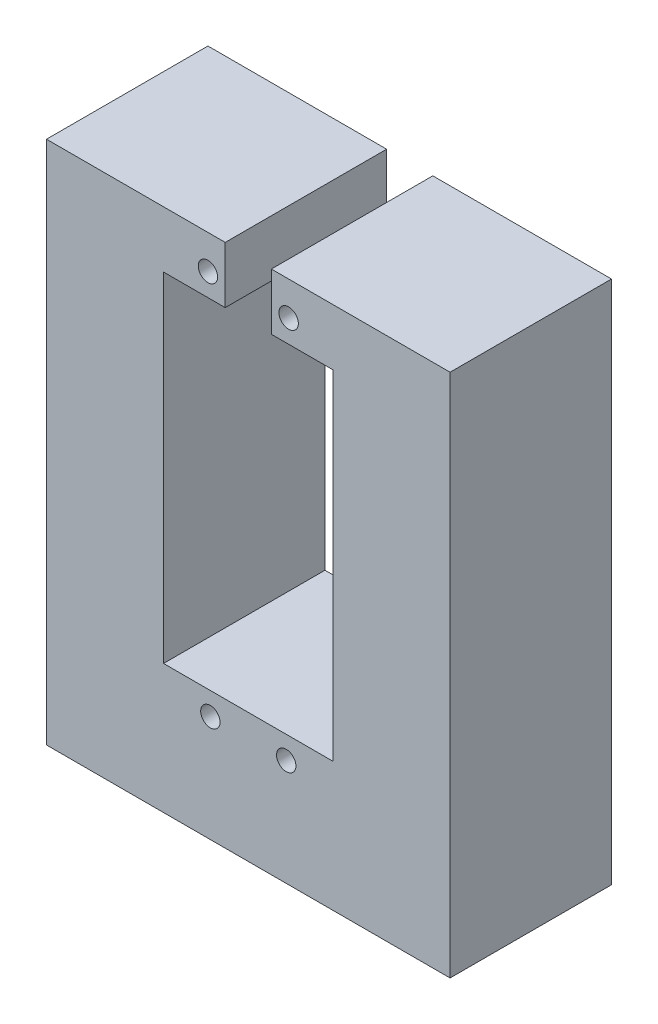
ISO-10303-21;
HEADER;
FILE_DESCRIPTION(('STEP AP214'),'2;1');
FILE_NAME('part.step','',(''),(''),'','','');
FILE_SCHEMA(('AUTOMOTIVE_DESIGN { 1 0 10303 214 1 1 1 1 }'));
ENDSEC;
DATA;
#1=APPLICATION_CONTEXT('core data for automotive mechanical design processes');
#2=APPLICATION_PROTOCOL_DEFINITION('international standard','automotive_design',2000,#1);
#3=PRODUCT_CONTEXT('',#1,'mechanical');
#4=PRODUCT('Part','Part','',(#3));
#5=PRODUCT_RELATED_PRODUCT_CATEGORY('part','',(#4));
#6=PRODUCT_DEFINITION_FORMATION('','',#4);
#7=PRODUCT_DEFINITION_CONTEXT('part definition',#1,'design');
#8=PRODUCT_DEFINITION('design','',#6,#7);
#9=PRODUCT_DEFINITION_SHAPE('','',#8);
#10=(LENGTH_UNIT() NAMED_UNIT(*) SI_UNIT(.MILLI.,.METRE.));
#11=(NAMED_UNIT(*) PLANE_ANGLE_UNIT() SI_UNIT($,.RADIAN.));
#12=(NAMED_UNIT(*) SI_UNIT($,.STERADIAN.) SOLID_ANGLE_UNIT());
#13=UNCERTAINTY_MEASURE_WITH_UNIT(LENGTH_MEASURE(1.E-05),#10,'distance_accuracy_value','');
#14=(GEOMETRIC_REPRESENTATION_CONTEXT(3) GLOBAL_UNCERTAINTY_ASSIGNED_CONTEXT((#13)) GLOBAL_UNIT_ASSIGNED_CONTEXT((#10,
#11,#12)) REPRESENTATION_CONTEXT('',''));
#15=CARTESIAN_POINT('',(0.,0.,0.));
#16=DIRECTION('',(0.,0.,1.));
#17=DIRECTION('',(1.,0.,0.));
#18=AXIS2_PLACEMENT_3D('',#15,#16,#17);
#19=CARTESIAN_POINT('',(27.0833333333333,65.,20.));
#20=DIRECTION('',(0.,-1.,0.));
#21=DIRECTION('',(0.,0.,-1.));
#22=AXIS2_PLACEMENT_3D('',#19,#20,#21);
#23=PLANE('',#22);
#24=DIRECTION('',(0.,0.,-1.));
#25=VECTOR('',#24,1.);
#26=CARTESIAN_POINT('',(4.94225050768781,65.,28.));
#27=LINE('',#26,#25);
#28=CARTESIAN_POINT('',(4.94225050768781,65.,20.));
#29=VERTEX_POINT('',#28);
#30=CARTESIAN_POINT('',(4.94225050768781,65.,0.));
#31=VERTEX_POINT('',#30);
#32=EDGE_CURVE('E189',#29,#31,#27,.T.);
#33=ORIENTED_EDGE('',*,*,#32,.F.);
#34=DIRECTION('',(-1.,0.,0.));
#35=VECTOR('',#34,1.);
#36=CARTESIAN_POINT('',(27.0833333333333,65.,20.));
#37=LINE('',#36,#35);
#38=CARTESIAN_POINT('',(27.0833333333333,65.,20.));
#39=VERTEX_POINT('',#38);
#40=EDGE_CURVE('E227',#39,#29,#37,.T.);
#41=ORIENTED_EDGE('',*,*,#40,.F.);
#42=DIRECTION('',(0.,0.,-1.));
#43=VECTOR('',#42,1.);
#44=CARTESIAN_POINT('',(27.0833333333333,65.,20.));
#45=LINE('',#44,#43);
#46=CARTESIAN_POINT('',(27.0833333333333,65.,0.));
#47=VERTEX_POINT('',#46);
#48=EDGE_CURVE('E240',#39,#47,#45,.T.);
#49=ORIENTED_EDGE('',*,*,#48,.T.);
#50=DIRECTION('',(-1.,0.,0.));
#51=VECTOR('',#50,1.);
#52=CARTESIAN_POINT('',(27.0833333333333,65.,0.));
#53=LINE('',#52,#51);
#54=EDGE_CURVE('E223',#47,#31,#53,.T.);
#55=ORIENTED_EDGE('',*,*,#54,.T.);
#56=EDGE_LOOP('',(#33,#41,#49,#55));
#57=FACE_BOUND('',#56,.T.);
#58=ADVANCED_FACE('F37',(#57),#23,.F.);
#59=DIRECTION('',(0.,0.,-1.));
#60=VECTOR('',#59,1.);
#61=CARTESIAN_POINT('',(-0.775583841021168,65.,28.));
#62=LINE('',#61,#60);
#63=CARTESIAN_POINT('',(-0.775583841021168,65.,20.));
#64=VERTEX_POINT('',#63);
#65=CARTESIAN_POINT('',(-0.775583841021168,65.,0.));
#66=VERTEX_POINT('',#65);
#67=EDGE_CURVE('E187',#64,#66,#62,.T.);
#68=ORIENTED_EDGE('',*,*,#67,.T.);
#69=CARTESIAN_POINT('',(-22.9166666666667,65.,0.));
#70=VERTEX_POINT('',#69);
#71=EDGE_CURVE('E83',#66,#70,#53,.T.);
#72=ORIENTED_EDGE('',*,*,#71,.T.);
#73=DIRECTION('',(0.,0.,-1.));
#74=VECTOR('',#73,1.);
#75=CARTESIAN_POINT('',(-22.9166666666667,65.,20.));
#76=LINE('',#75,#74);
#77=CARTESIAN_POINT('',(-22.9166666666667,65.,20.));
#78=VERTEX_POINT('',#77);
#79=EDGE_CURVE('E230',#78,#70,#76,.T.);
#80=ORIENTED_EDGE('',*,*,#79,.F.);
#81=EDGE_CURVE('E61',#64,#78,#37,.T.);
#82=ORIENTED_EDGE('',*,*,#81,.F.);
#83=EDGE_LOOP('',(#68,#72,#80,#82));
#84=FACE_BOUND('',#83,.T.);
#85=ADVANCED_FACE('F271',(#84),#23,.F.);
#86=CARTESIAN_POINT('',(0.,0.,20.));
#87=DIRECTION('',(0.,0.,1.));
#88=DIRECTION('',(1.,0.,0.));
#89=AXIS2_PLACEMENT_3D('',#86,#87,#88);
#90=PLANE('',#89);
#91=CARTESIAN_POINT('',(6.78333333333332,13.19,20.));
#92=DIRECTION('',(0.,0.,1.));
#93=DIRECTION('',(1.,0.,0.));
#94=AXIS2_PLACEMENT_3D('',#91,#92,#93);
#95=CIRCLE('',#94,1.2);
#96=CARTESIAN_POINT('',(7.98333333333332,13.19,20.));
#97=VERTEX_POINT('',#96);
#98=EDGE_CURVE('E214',#97,#97,#95,.F.);
#99=ORIENTED_EDGE('',*,*,#98,.T.);
#100=EDGE_LOOP('',(#99));
#101=FACE_BOUND('',#100,.T.);
#102=CARTESIAN_POINT('',(-2.91666666666668,60.81,20.));
#103=DIRECTION('',(0.,0.,1.));
#104=DIRECTION('',(1.,0.,0.));
#105=AXIS2_PLACEMENT_3D('',#102,#103,#104);
#106=CIRCLE('',#105,1.2);
#107=CARTESIAN_POINT('',(-1.71666666666668,60.81,20.));
#108=VERTEX_POINT('',#107);
#109=EDGE_CURVE('E208',#108,#108,#106,.F.);
#110=ORIENTED_EDGE('',*,*,#109,.T.);
#111=EDGE_LOOP('',(#110));
#112=FACE_BOUND('',#111,.T.);
#113=ORIENTED_EDGE('',*,*,#40,.T.);
#114=DIRECTION('',(0.,-1.,0.));
#115=VECTOR('',#114,1.);
#116=CARTESIAN_POINT('',(4.94225050768782,0.,20.));
#117=LINE('',#116,#115);
#118=CARTESIAN_POINT('',(4.94225050768781,58.,20.));
#119=VERTEX_POINT('',#118);
#120=EDGE_CURVE('E202',#29,#119,#117,.T.);
#121=ORIENTED_EDGE('',*,*,#120,.T.);
#122=DIRECTION('',(1.,0.,0.));
#123=VECTOR('',#122,1.);
#124=CARTESIAN_POINT('',(0.,58.,20.));
#125=LINE('',#124,#123);
#126=CARTESIAN_POINT('',(12.5833333333333,58.,20.));
#127=VERTEX_POINT('',#126);
#128=EDGE_CURVE('E205',#119,#127,#125,.T.);
#129=ORIENTED_EDGE('',*,*,#128,.T.);
#130=DIRECTION('',(0.,-1.,0.));
#131=VECTOR('',#130,1.);
#132=CARTESIAN_POINT('',(12.5833333333333,0.,20.));
#133=LINE('',#132,#131);
#134=CARTESIAN_POINT('',(12.5833333333333,16.,20.));
#135=VERTEX_POINT('',#134);
#136=EDGE_CURVE('E139',#127,#135,#133,.T.);
#137=ORIENTED_EDGE('',*,*,#136,.T.);
#138=DIRECTION('',(-1.,0.,0.));
#139=VECTOR('',#138,1.);
#140=CARTESIAN_POINT('',(0.,16.,20.));
#141=LINE('',#140,#139);
#142=CARTESIAN_POINT('',(-8.41666666666667,16.,20.));
#143=VERTEX_POINT('',#142);
#144=EDGE_CURVE('E142',#135,#143,#141,.T.);
#145=ORIENTED_EDGE('',*,*,#144,.T.);
#146=DIRECTION('',(0.,1.,0.));
#147=VECTOR('',#146,1.);
#148=CARTESIAN_POINT('',(-8.41666666666667,0.,20.));
#149=LINE('',#148,#147);
#150=CARTESIAN_POINT('',(-8.41666666666667,58.,20.));
#151=VERTEX_POINT('',#150);
#152=EDGE_CURVE('E194',#143,#151,#149,.T.);
#153=ORIENTED_EDGE('',*,*,#152,.T.);
#154=DIRECTION('',(1.,0.,0.));
#155=VECTOR('',#154,1.);
#156=CARTESIAN_POINT('',(0.,58.,20.));
#157=LINE('',#156,#155);
#158=CARTESIAN_POINT('',(-0.775583841021168,58.,20.));
#159=VERTEX_POINT('',#158);
#160=EDGE_CURVE('E197',#151,#159,#157,.T.);
#161=ORIENTED_EDGE('',*,*,#160,.T.);
#162=DIRECTION('',(0.,1.,0.));
#163=VECTOR('',#162,1.);
#164=CARTESIAN_POINT('',(-0.77558384102116,0.,20.));
#165=LINE('',#164,#163);
#166=EDGE_CURVE('E200',#159,#64,#165,.T.);
#167=ORIENTED_EDGE('',*,*,#166,.T.);
#168=ORIENTED_EDGE('',*,*,#81,.T.);
#169=DIRECTION('',(0.,-1.,0.));
#170=VECTOR('',#169,1.);
#171=CARTESIAN_POINT('',(-22.9166666666667,0.,20.));
#172=LINE('',#171,#170);
#173=CARTESIAN_POINT('',(-22.9166666666667,0.,20.));
#174=VERTEX_POINT('',#173);
#175=EDGE_CURVE('E221',#78,#174,#172,.T.);
#176=ORIENTED_EDGE('',*,*,#175,.T.);
#177=DIRECTION('',(1.,0.,0.));
#178=VECTOR('',#177,1.);
#179=CARTESIAN_POINT('',(-22.9166666666667,0.,20.));
#180=LINE('',#179,#178);
#181=CARTESIAN_POINT('',(27.0833333333333,0.,20.));
#182=VERTEX_POINT('',#181);
#183=EDGE_CURVE('E90',#174,#182,#180,.T.);
#184=ORIENTED_EDGE('',*,*,#183,.T.);
#185=DIRECTION('',(0.,1.,0.));
#186=VECTOR('',#185,1.);
#187=CARTESIAN_POINT('',(27.0833333333333,0.,20.));
#188=LINE('',#187,#186);
#189=EDGE_CURVE('E225',#182,#39,#188,.T.);
#190=ORIENTED_EDGE('',*,*,#189,.T.);
#191=EDGE_LOOP('',(#113,#121,#129,#137,#145,#153,#161,#167,#168,#176,#184,#190));
#192=FACE_BOUND('',#191,.T.);
#193=CARTESIAN_POINT('',(-2.61666666666667,13.19,20.));
#194=DIRECTION('',(0.,0.,1.));
#195=DIRECTION('',(1.,0.,0.));
#196=AXIS2_PLACEMENT_3D('',#193,#194,#195);
#197=CIRCLE('',#196,1.2);
#198=CARTESIAN_POINT('',(-1.41666666666667,13.19,20.));
#199=VERTEX_POINT('',#198);
#200=EDGE_CURVE('E211',#199,#199,#197,.F.);
#201=ORIENTED_EDGE('',*,*,#200,.T.);
#202=EDGE_LOOP('',(#201));
#203=FACE_BOUND('',#202,.T.);
#204=CARTESIAN_POINT('',(7.08333333333332,60.81,20.));
#205=DIRECTION('',(0.,0.,1.));
#206=DIRECTION('',(1.,0.,0.));
#207=AXIS2_PLACEMENT_3D('',#204,#205,#206);
#208=CIRCLE('',#207,1.2);
#209=CARTESIAN_POINT('',(8.28333333333332,60.81,20.));
#210=VERTEX_POINT('',#209);
#211=EDGE_CURVE('E217',#210,#210,#208,.F.);
#212=ORIENTED_EDGE('',*,*,#211,.T.);
#213=EDGE_LOOP('',(#212));
#214=FACE_BOUND('',#213,.T.);
#215=ADVANCED_FACE('F253',(#101,#112,#192,#203,#214),#90,.T.);
#216=CARTESIAN_POINT('',(0.,0.,0.));
#217=DIRECTION('',(0.,0.,1.));
#218=DIRECTION('',(1.,0.,0.));
#219=AXIS2_PLACEMENT_3D('',#216,#217,#218);
#220=PLANE('',#219);
#221=DIRECTION('',(0.,1.,0.));
#222=VECTOR('',#221,1.);
#223=CARTESIAN_POINT('',(4.94225050768781,65.,0.));
#224=LINE('',#223,#222);
#225=CARTESIAN_POINT('',(4.94225050768781,58.,0.));
#226=VERTEX_POINT('',#225);
#227=EDGE_CURVE('E152',#226,#31,#224,.T.);
#228=ORIENTED_EDGE('',*,*,#227,.T.);
#229=ORIENTED_EDGE('',*,*,#54,.F.);
#230=DIRECTION('',(0.,1.,0.));
#231=VECTOR('',#230,1.);
#232=CARTESIAN_POINT('',(27.0833333333333,0.,0.));
#233=LINE('',#232,#231);
#234=CARTESIAN_POINT('',(27.0833333333333,0.,0.));
#235=VERTEX_POINT('',#234);
#236=EDGE_CURVE('E235',#235,#47,#233,.T.);
#237=ORIENTED_EDGE('',*,*,#236,.F.);
#238=DIRECTION('',(1.,0.,0.));
#239=VECTOR('',#238,1.);
#240=CARTESIAN_POINT('',(-22.9166666666667,0.,0.));
#241=LINE('',#240,#239);
#242=CARTESIAN_POINT('',(-22.9166666666667,0.,0.));
#243=VERTEX_POINT('',#242);
#244=EDGE_CURVE('E233',#243,#235,#241,.T.);
#245=ORIENTED_EDGE('',*,*,#244,.F.);
#246=DIRECTION('',(0.,-1.,0.));
#247=VECTOR('',#246,1.);
#248=CARTESIAN_POINT('',(-22.9166666666667,0.,0.));
#249=LINE('',#248,#247);
#250=EDGE_CURVE('E220',#70,#243,#249,.T.);
#251=ORIENTED_EDGE('',*,*,#250,.F.);
#252=ORIENTED_EDGE('',*,*,#71,.F.);
#253=DIRECTION('',(0.,-1.,0.));
#254=VECTOR('',#253,1.);
#255=CARTESIAN_POINT('',(-0.775583841021168,65.,0.));
#256=LINE('',#255,#254);
#257=CARTESIAN_POINT('',(-0.775583841021168,58.,0.));
#258=VERTEX_POINT('',#257);
#259=EDGE_CURVE('E170',#66,#258,#256,.T.);
#260=ORIENTED_EDGE('',*,*,#259,.T.);
#261=DIRECTION('',(-1.,0.,0.));
#262=VECTOR('',#261,1.);
#263=CARTESIAN_POINT('',(-0.775583841021168,58.,0.));
#264=LINE('',#263,#262);
#265=CARTESIAN_POINT('',(-8.41666666666667,58.,0.));
#266=VERTEX_POINT('',#265);
#267=EDGE_CURVE('E173',#258,#266,#264,.T.);
#268=ORIENTED_EDGE('',*,*,#267,.T.);
#269=DIRECTION('',(0.,-1.,0.));
#270=VECTOR('',#269,1.);
#271=CARTESIAN_POINT('',(-8.41666666666667,58.,0.));
#272=LINE('',#271,#270);
#273=CARTESIAN_POINT('',(-8.41666666666667,16.,0.));
#274=VERTEX_POINT('',#273);
#275=EDGE_CURVE('E176',#266,#274,#272,.T.);
#276=ORIENTED_EDGE('',*,*,#275,.T.);
#277=DIRECTION('',(1.,0.,0.));
#278=VECTOR('',#277,1.);
#279=CARTESIAN_POINT('',(-8.41666666666667,16.,0.));
#280=LINE('',#279,#278);
#281=CARTESIAN_POINT('',(12.5833333333333,16.,0.));
#282=VERTEX_POINT('',#281);
#283=EDGE_CURVE('E159',#274,#282,#280,.T.);
#284=ORIENTED_EDGE('',*,*,#283,.T.);
#285=DIRECTION('',(0.,1.,0.));
#286=VECTOR('',#285,1.);
#287=CARTESIAN_POINT('',(12.5833333333333,58.,0.));
#288=LINE('',#287,#286);
#289=CARTESIAN_POINT('',(12.5833333333333,58.,0.));
#290=VERTEX_POINT('',#289);
#291=EDGE_CURVE('E52',#282,#290,#288,.T.);
#292=ORIENTED_EDGE('',*,*,#291,.T.);
#293=DIRECTION('',(-1.,0.,0.));
#294=VECTOR('',#293,1.);
#295=CARTESIAN_POINT('',(4.94225050768781,58.,0.));
#296=LINE('',#295,#294);
#297=EDGE_CURVE('E146',#290,#226,#296,.T.);
#298=ORIENTED_EDGE('',*,*,#297,.T.);
#299=EDGE_LOOP('',(#228,#229,#237,#245,#251,#252,#260,#268,#276,#284,#292,#298));
#300=FACE_BOUND('',#299,.T.);
#301=CARTESIAN_POINT('',(-2.91666666666668,60.81,0.));
#302=DIRECTION('',(0.,0.,1.));
#303=DIRECTION('',(1.,0.,0.));
#304=AXIS2_PLACEMENT_3D('',#301,#302,#303);
#305=CIRCLE('',#304,1.2);
#306=CARTESIAN_POINT('',(-1.71666666666668,60.81,0.));
#307=VERTEX_POINT('',#306);
#308=EDGE_CURVE('E160',#307,#307,#305,.T.);
#309=ORIENTED_EDGE('',*,*,#308,.T.);
#310=EDGE_LOOP('',(#309));
#311=FACE_BOUND('',#310,.T.);
#312=CARTESIAN_POINT('',(-2.61666666666667,13.19,0.));
#313=DIRECTION('',(0.,0.,1.));
#314=DIRECTION('',(1.,0.,0.));
#315=AXIS2_PLACEMENT_3D('',#312,#313,#314);
#316=CIRCLE('',#315,1.2);
#317=CARTESIAN_POINT('',(-1.41666666666667,13.19,0.));
#318=VERTEX_POINT('',#317);
#319=EDGE_CURVE('E163',#318,#318,#316,.T.);
#320=ORIENTED_EDGE('',*,*,#319,.T.);
#321=EDGE_LOOP('',(#320));
#322=FACE_BOUND('',#321,.T.);
#323=CARTESIAN_POINT('',(6.78333333333332,13.19,0.));
#324=DIRECTION('',(0.,0.,1.));
#325=DIRECTION('',(-1.,0.,0.));
#326=AXIS2_PLACEMENT_3D('',#323,#324,#325);
#327=CIRCLE('',#326,1.2);
#328=CARTESIAN_POINT('',(5.58333333333332,13.19,0.));
#329=VERTEX_POINT('',#328);
#330=EDGE_CURVE('E346',#329,#329,#327,.T.);
#331=ORIENTED_EDGE('',*,*,#330,.T.);
#332=EDGE_LOOP('',(#331));
#333=FACE_BOUND('',#332,.T.);
#334=CARTESIAN_POINT('',(7.08333333333332,60.81,0.));
#335=DIRECTION('',(0.,0.,1.));
#336=DIRECTION('',(-1.,0.,0.));
#337=AXIS2_PLACEMENT_3D('',#334,#335,#336);
#338=CIRCLE('',#337,1.2);
#339=CARTESIAN_POINT('',(5.88333333333332,60.81,0.));
#340=VERTEX_POINT('',#339);
#341=EDGE_CURVE('E166',#340,#340,#338,.T.);
#342=ORIENTED_EDGE('',*,*,#341,.T.);
#343=EDGE_LOOP('',(#342));
#344=FACE_BOUND('',#343,.T.);
#345=ADVANCED_FACE('F155',(#300,#311,#322,#333,#344),#220,.F.);
#346=CARTESIAN_POINT('',(-22.9166666666667,0.,20.));
#347=DIRECTION('',(1.,0.,0.));
#348=DIRECTION('',(0.,0.,-1.));
#349=AXIS2_PLACEMENT_3D('',#346,#347,#348);
#350=PLANE('',#349);
#351=ORIENTED_EDGE('',*,*,#250,.T.);
#352=DIRECTION('',(0.,0.,-1.));
#353=VECTOR('',#352,1.);
#354=CARTESIAN_POINT('',(-22.9166666666667,0.,20.));
#355=LINE('',#354,#353);
#356=EDGE_CURVE('E11',#174,#243,#355,.T.);
#357=ORIENTED_EDGE('',*,*,#356,.F.);
#358=ORIENTED_EDGE('',*,*,#175,.F.);
#359=ORIENTED_EDGE('',*,*,#79,.T.);
#360=EDGE_LOOP('',(#351,#357,#358,#359));
#361=FACE_BOUND('',#360,.T.);
#362=ADVANCED_FACE('F39',(#361),#350,.F.);
#363=CARTESIAN_POINT('',(-22.9166666666667,0.,20.));
#364=DIRECTION('',(0.,1.,0.));
#365=DIRECTION('',(0.,0.,1.));
#366=AXIS2_PLACEMENT_3D('',#363,#364,#365);
#367=PLANE('',#366);
#368=CARTESIAN_POINT('',(-15.2326694861474,0.,9.91889460037737));
#369=DIRECTION('',(0.,1.,0.));
#370=DIRECTION('',(0.,0.,1.));
#371=AXIS2_PLACEMENT_3D('',#368,#369,#370);
#372=CIRCLE('',#371,7.);
#373=CARTESIAN_POINT('',(-15.2326694861474,0.,16.9188946003774));
#374=VERTEX_POINT('',#373);
#375=EDGE_CURVE('E343',#374,#374,#372,.T.);
#376=ORIENTED_EDGE('',*,*,#375,.T.);
#377=EDGE_LOOP('',(#376));
#378=FACE_BOUND('',#377,.T.);
#379=CARTESIAN_POINT('',(18.7673305138526,0.,9.91889460037737));
#380=DIRECTION('',(0.,1.,0.));
#381=DIRECTION('',(0.,0.,1.));
#382=AXIS2_PLACEMENT_3D('',#379,#380,#381);
#383=CIRCLE('',#382,7.);
#384=CARTESIAN_POINT('',(18.7673305138526,0.,16.9188946003774));
#385=VERTEX_POINT('',#384);
#386=EDGE_CURVE('E352',#385,#385,#383,.T.);
#387=ORIENTED_EDGE('',*,*,#386,.T.);
#388=EDGE_LOOP('',(#387));
#389=FACE_BOUND('',#388,.T.);
#390=ORIENTED_EDGE('',*,*,#244,.T.);
#391=DIRECTION('',(0.,0.,-1.));
#392=VECTOR('',#391,1.);
#393=CARTESIAN_POINT('',(27.0833333333333,0.,20.));
#394=LINE('',#393,#392);
#395=EDGE_CURVE('E45',#182,#235,#394,.T.);
#396=ORIENTED_EDGE('',*,*,#395,.F.);
#397=ORIENTED_EDGE('',*,*,#183,.F.);
#398=ORIENTED_EDGE('',*,*,#356,.T.);
#399=EDGE_LOOP('',(#390,#396,#397,#398));
#400=FACE_BOUND('',#399,.T.);
#401=ADVANCED_FACE('F258',(#378,#389,#400),#367,.F.);
#402=CARTESIAN_POINT('',(27.0833333333333,0.,20.));
#403=DIRECTION('',(-1.,0.,0.));
#404=DIRECTION('',(0.,0.,1.));
#405=AXIS2_PLACEMENT_3D('',#402,#403,#404);
#406=PLANE('',#405);
#407=ORIENTED_EDGE('',*,*,#236,.T.);
#408=ORIENTED_EDGE('',*,*,#48,.F.);
#409=ORIENTED_EDGE('',*,*,#189,.F.);
#410=ORIENTED_EDGE('',*,*,#395,.T.);
#411=EDGE_LOOP('',(#407,#408,#409,#410));
#412=FACE_BOUND('',#411,.T.);
#413=ADVANCED_FACE('F246',(#412),#406,.F.);
#414=CARTESIAN_POINT('',(12.5833333333333,58.,28.));
#415=DIRECTION('',(-1.,0.,0.));
#416=DIRECTION('',(0.,-1.,0.));
#417=AXIS2_PLACEMENT_3D('',#414,#415,#416);
#418=PLANE('',#417);
#419=DIRECTION('',(0.,0.,-1.));
#420=VECTOR('',#419,1.);
#421=CARTESIAN_POINT('',(12.5833333333333,58.,28.));
#422=LINE('',#421,#420);
#423=EDGE_CURVE('E135',#127,#290,#422,.T.);
#424=ORIENTED_EDGE('',*,*,#423,.T.);
#425=ORIENTED_EDGE('',*,*,#291,.F.);
#426=DIRECTION('',(0.,0.,-1.));
#427=VECTOR('',#426,1.);
#428=CARTESIAN_POINT('',(12.5833333333333,16.,28.));
#429=LINE('',#428,#427);
#430=EDGE_CURVE('E179',#135,#282,#429,.T.);
#431=ORIENTED_EDGE('',*,*,#430,.F.);
#432=ORIENTED_EDGE('',*,*,#136,.F.);
#433=EDGE_LOOP('',(#424,#425,#431,#432));
#434=FACE_BOUND('',#433,.T.);
#435=ADVANCED_FACE('F137',(#434),#418,.T.);
#436=CARTESIAN_POINT('',(4.94225050768781,58.,28.));
#437=DIRECTION('',(0.,-1.,0.));
#438=DIRECTION('',(0.,0.,-1.));
#439=AXIS2_PLACEMENT_3D('',#436,#437,#438);
#440=PLANE('',#439);
#441=DIRECTION('',(0.,0.,-1.));
#442=VECTOR('',#441,1.);
#443=CARTESIAN_POINT('',(4.94225050768781,58.,28.));
#444=LINE('',#443,#442);
#445=EDGE_CURVE('E143',#119,#226,#444,.T.);
#446=ORIENTED_EDGE('',*,*,#445,.T.);
#447=ORIENTED_EDGE('',*,*,#297,.F.);
#448=ORIENTED_EDGE('',*,*,#423,.F.);
#449=ORIENTED_EDGE('',*,*,#128,.F.);
#450=EDGE_LOOP('',(#446,#447,#448,#449));
#451=FACE_BOUND('',#450,.T.);
#452=ADVANCED_FACE('F147',(#451),#440,.T.);
#453=CARTESIAN_POINT('',(4.94225050768781,65.,28.));
#454=DIRECTION('',(-1.,0.,0.));
#455=DIRECTION('',(0.,-1.,0.));
#456=AXIS2_PLACEMENT_3D('',#453,#454,#455);
#457=PLANE('',#456);
#458=ORIENTED_EDGE('',*,*,#32,.T.);
#459=ORIENTED_EDGE('',*,*,#227,.F.);
#460=ORIENTED_EDGE('',*,*,#445,.F.);
#461=ORIENTED_EDGE('',*,*,#120,.F.);
#462=EDGE_LOOP('',(#458,#459,#460,#461));
#463=FACE_BOUND('',#462,.T.);
#464=ADVANCED_FACE('F287',(#463),#457,.T.);
#465=CARTESIAN_POINT('',(-0.775583841021168,65.,28.));
#466=DIRECTION('',(1.,0.,0.));
#467=DIRECTION('',(0.,1.,0.));
#468=AXIS2_PLACEMENT_3D('',#465,#466,#467);
#469=PLANE('',#468);
#470=DIRECTION('',(0.,0.,-1.));
#471=VECTOR('',#470,1.);
#472=CARTESIAN_POINT('',(-0.775583841021168,58.,28.));
#473=LINE('',#472,#471);
#474=EDGE_CURVE('E185',#159,#258,#473,.T.);
#475=ORIENTED_EDGE('',*,*,#474,.T.);
#476=ORIENTED_EDGE('',*,*,#259,.F.);
#477=ORIENTED_EDGE('',*,*,#67,.F.);
#478=ORIENTED_EDGE('',*,*,#166,.F.);
#479=EDGE_LOOP('',(#475,#476,#477,#478));
#480=FACE_BOUND('',#479,.T.);
#481=ADVANCED_FACE('F290',(#480),#469,.T.);
#482=CARTESIAN_POINT('',(-0.775583841021168,58.,28.));
#483=DIRECTION('',(0.,-1.,0.));
#484=DIRECTION('',(0.,0.,-1.));
#485=AXIS2_PLACEMENT_3D('',#482,#483,#484);
#486=PLANE('',#485);
#487=DIRECTION('',(0.,0.,-1.));
#488=VECTOR('',#487,1.);
#489=CARTESIAN_POINT('',(-8.41666666666667,58.,28.));
#490=LINE('',#489,#488);
#491=EDGE_CURVE('E183',#151,#266,#490,.T.);
#492=ORIENTED_EDGE('',*,*,#491,.T.);
#493=ORIENTED_EDGE('',*,*,#267,.F.);
#494=ORIENTED_EDGE('',*,*,#474,.F.);
#495=ORIENTED_EDGE('',*,*,#160,.F.);
#496=EDGE_LOOP('',(#492,#493,#494,#495));
#497=FACE_BOUND('',#496,.T.);
#498=ADVANCED_FACE('F294',(#497),#486,.T.);
#499=CARTESIAN_POINT('',(-8.41666666666667,58.,28.));
#500=DIRECTION('',(1.,0.,0.));
#501=DIRECTION('',(0.,1.,0.));
#502=AXIS2_PLACEMENT_3D('',#499,#500,#501);
#503=PLANE('',#502);
#504=DIRECTION('',(0.,0.,-1.));
#505=VECTOR('',#504,1.);
#506=CARTESIAN_POINT('',(-8.41666666666667,16.,28.));
#507=LINE('',#506,#505);
#508=EDGE_CURVE('E181',#143,#274,#507,.T.);
#509=ORIENTED_EDGE('',*,*,#508,.T.);
#510=ORIENTED_EDGE('',*,*,#275,.F.);
#511=ORIENTED_EDGE('',*,*,#491,.F.);
#512=ORIENTED_EDGE('',*,*,#152,.F.);
#513=EDGE_LOOP('',(#509,#510,#511,#512));
#514=FACE_BOUND('',#513,.T.);
#515=ADVANCED_FACE('F298',(#514),#503,.T.);
#516=CARTESIAN_POINT('',(-8.41666666666667,16.,28.));
#517=DIRECTION('',(0.,1.,0.));
#518=DIRECTION('',(-1.,0.,0.));
#519=AXIS2_PLACEMENT_3D('',#516,#517,#518);
#520=PLANE('',#519);
#521=ORIENTED_EDGE('',*,*,#430,.T.);
#522=ORIENTED_EDGE('',*,*,#283,.F.);
#523=ORIENTED_EDGE('',*,*,#508,.F.);
#524=ORIENTED_EDGE('',*,*,#144,.F.);
#525=EDGE_LOOP('',(#521,#522,#523,#524));
#526=FACE_BOUND('',#525,.T.);
#527=ADVANCED_FACE('F302',(#526),#520,.T.);
#528=CARTESIAN_POINT('',(-2.91666666666668,60.81,28.));
#529=DIRECTION('',(0.,0.,-1.));
#530=DIRECTION('',(-1.,0.,0.));
#531=AXIS2_PLACEMENT_3D('',#528,#529,#530);
#532=CYLINDRICAL_SURFACE('',#531,1.2);
#533=ORIENTED_EDGE('',*,*,#109,.F.);
#534=EDGE_LOOP('',(#533));
#535=FACE_BOUND('',#534,.T.);
#536=ORIENTED_EDGE('',*,*,#308,.F.);
#537=EDGE_LOOP('',(#536));
#538=FACE_BOUND('',#537,.T.);
#539=ADVANCED_FACE('F306',(#535,#538),#532,.F.);
#540=CARTESIAN_POINT('',(-2.61666666666667,13.19,28.));
#541=DIRECTION('',(0.,0.,-1.));
#542=DIRECTION('',(-1.,0.,0.));
#543=AXIS2_PLACEMENT_3D('',#540,#541,#542);
#544=CYLINDRICAL_SURFACE('',#543,1.2);
#545=ORIENTED_EDGE('',*,*,#200,.F.);
#546=EDGE_LOOP('',(#545));
#547=FACE_BOUND('',#546,.T.);
#548=ORIENTED_EDGE('',*,*,#319,.F.);
#549=EDGE_LOOP('',(#548));
#550=FACE_BOUND('',#549,.T.);
#551=ADVANCED_FACE('F316',(#547,#550),#544,.F.);
#552=CARTESIAN_POINT('',(6.78333333333332,13.19,28.));
#553=DIRECTION('',(0.,0.,-1.));
#554=DIRECTION('',(-1.,0.,0.));
#555=AXIS2_PLACEMENT_3D('',#552,#553,#554);
#556=CYLINDRICAL_SURFACE('',#555,1.2);
#557=ORIENTED_EDGE('',*,*,#98,.F.);
#558=EDGE_LOOP('',(#557));
#559=FACE_BOUND('',#558,.T.);
#560=ORIENTED_EDGE('',*,*,#330,.F.);
#561=EDGE_LOOP('',(#560));
#562=FACE_BOUND('',#561,.T.);
#563=ADVANCED_FACE('F312',(#559,#562),#556,.F.);
#564=CARTESIAN_POINT('',(7.08333333333332,60.81,28.));
#565=DIRECTION('',(0.,0.,-1.));
#566=DIRECTION('',(-1.,0.,0.));
#567=AXIS2_PLACEMENT_3D('',#564,#565,#566);
#568=CYLINDRICAL_SURFACE('',#567,1.2);
#569=ORIENTED_EDGE('',*,*,#211,.F.);
#570=EDGE_LOOP('',(#569));
#571=FACE_BOUND('',#570,.T.);
#572=ORIENTED_EDGE('',*,*,#341,.F.);
#573=EDGE_LOOP('',(#572));
#574=FACE_BOUND('',#573,.T.);
#575=ADVANCED_FACE('F308',(#571,#574),#568,.F.);
#576=CARTESIAN_POINT('',(18.7673305138526,15.,9.91889460037737));
#577=DIRECTION('',(0.,-1.,0.));
#578=DIRECTION('',(0.,0.,-1.));
#579=AXIS2_PLACEMENT_3D('',#576,#577,#578);
#580=CYLINDRICAL_SURFACE('',#579,7.);
#581=CARTESIAN_POINT('',(18.7673305138526,15.,9.91889460037737));
#582=DIRECTION('',(0.,1.,0.));
#583=DIRECTION('',(0.,0.,1.));
#584=AXIS2_PLACEMENT_3D('',#581,#582,#583);
#585=CIRCLE('',#584,7.);
#586=CARTESIAN_POINT('',(18.7673305138526,15.,16.9188946003774));
#587=VERTEX_POINT('',#586);
#588=EDGE_CURVE('E347',#587,#587,#585,.T.);
#589=ORIENTED_EDGE('',*,*,#588,.T.);
#590=EDGE_LOOP('',(#589));
#591=FACE_BOUND('',#590,.T.);
#592=ORIENTED_EDGE('',*,*,#386,.F.);
#593=EDGE_LOOP('',(#592));
#594=FACE_BOUND('',#593,.T.);
#595=ADVANCED_FACE('F311',(#591,#594),#580,.F.);
#596=CARTESIAN_POINT('',(18.7673305138526,15.,9.91889460037737));
#597=DIRECTION('',(0.,1.,0.));
#598=DIRECTION('',(0.,0.,1.));
#599=AXIS2_PLACEMENT_3D('',#596,#597,#598);
#600=PLANE('',#599);
#601=ORIENTED_EDGE('',*,*,#588,.F.);
#602=EDGE_LOOP('',(#601));
#603=FACE_BOUND('',#602,.T.);
#604=ADVANCED_FACE('F326',(#603),#600,.F.);
#605=CARTESIAN_POINT('',(-15.2326694861474,15.,9.91889460037737));
#606=DIRECTION('',(0.,-1.,0.));
#607=DIRECTION('',(0.,0.,-1.));
#608=AXIS2_PLACEMENT_3D('',#605,#606,#607);
#609=CYLINDRICAL_SURFACE('',#608,7.);
#610=CARTESIAN_POINT('',(-15.2326694861474,15.,9.91889460037737));
#611=DIRECTION('',(0.,1.,0.));
#612=DIRECTION('',(0.,0.,1.));
#613=AXIS2_PLACEMENT_3D('',#610,#611,#612);
#614=CIRCLE('',#613,7.);
#615=CARTESIAN_POINT('',(-15.2326694861474,15.,16.9188946003774));
#616=VERTEX_POINT('',#615);
#617=EDGE_CURVE('E342',#616,#616,#614,.T.);
#618=ORIENTED_EDGE('',*,*,#617,.T.);
#619=EDGE_LOOP('',(#618));
#620=FACE_BOUND('',#619,.T.);
#621=ORIENTED_EDGE('',*,*,#375,.F.);
#622=EDGE_LOOP('',(#621));
#623=FACE_BOUND('',#622,.T.);
#624=ADVANCED_FACE('F330',(#620,#623),#609,.F.);
#625=CARTESIAN_POINT('',(-15.2326694861474,15.,9.91889460037737));
#626=DIRECTION('',(0.,1.,0.));
#627=DIRECTION('',(0.,0.,1.));
#628=AXIS2_PLACEMENT_3D('',#625,#626,#627);
#629=PLANE('',#628);
#630=ORIENTED_EDGE('',*,*,#617,.F.);
#631=EDGE_LOOP('',(#630));
#632=FACE_BOUND('',#631,.T.);
#633=ADVANCED_FACE('F334',(#632),#629,.F.);
#634=CLOSED_SHELL('',(#58,#85,#215,#345,#362,#401,#413,#435,#452,#464,#481,#498,#515,#527,#539,
#551,#563,#575,#595,#604,#624,#633));
#635=MANIFOLD_SOLID_BREP('B2',#634);
#636=ADVANCED_BREP_SHAPE_REPRESENTATION('',(#18,#635),#14);
#637=SHAPE_DEFINITION_REPRESENTATION(#9,#636);
ENDSEC;
END-ISO-10303-21;
